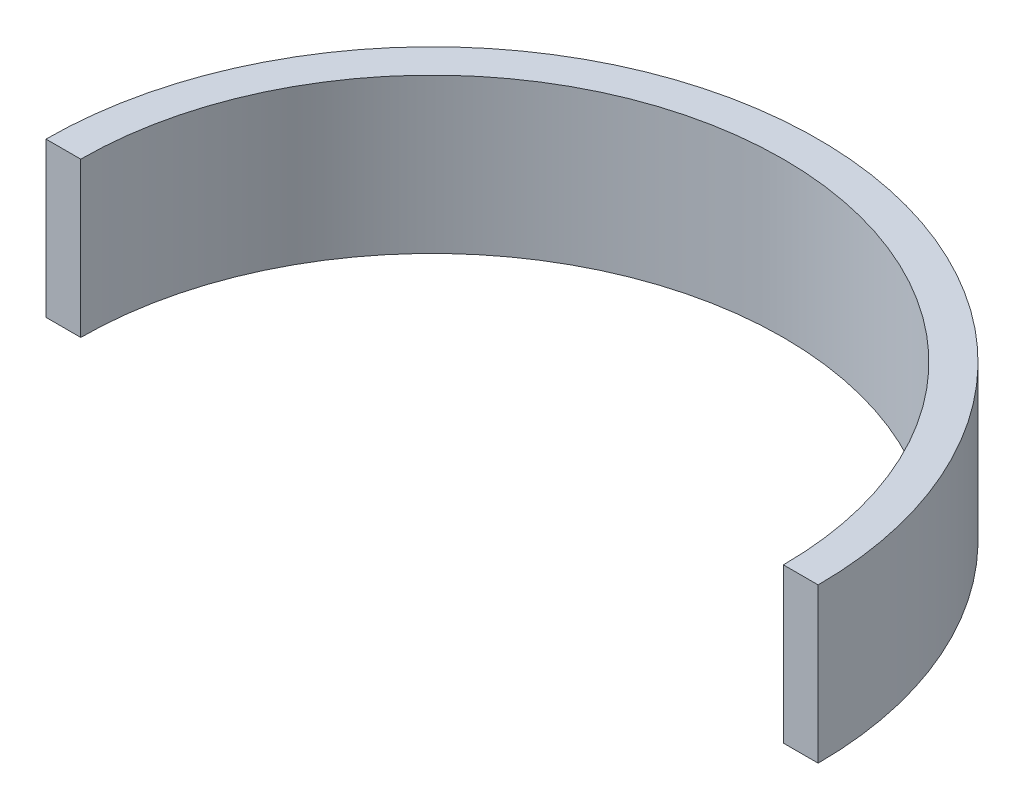
ISO-10303-21;
HEADER;
FILE_DESCRIPTION(('STEP AP214'),'2;1');
FILE_NAME('part.step','',(''),(''),'','','');
FILE_SCHEMA(('AUTOMOTIVE_DESIGN { 1 0 10303 214 1 1 1 1 }'));
ENDSEC;
DATA;
#1=APPLICATION_CONTEXT('core data for automotive mechanical design processes');
#2=APPLICATION_PROTOCOL_DEFINITION('international standard','automotive_design',2000,#1);
#3=PRODUCT_CONTEXT('',#1,'mechanical');
#4=PRODUCT('Part','Part','',(#3));
#5=PRODUCT_RELATED_PRODUCT_CATEGORY('part','',(#4));
#6=PRODUCT_DEFINITION_FORMATION('','',#4);
#7=PRODUCT_DEFINITION_CONTEXT('part definition',#1,'design');
#8=PRODUCT_DEFINITION('design','',#6,#7);
#9=PRODUCT_DEFINITION_SHAPE('','',#8);
#10=(LENGTH_UNIT() NAMED_UNIT(*) SI_UNIT(.MILLI.,.METRE.));
#11=(NAMED_UNIT(*) PLANE_ANGLE_UNIT() SI_UNIT($,.RADIAN.));
#12=(NAMED_UNIT(*) SI_UNIT($,.STERADIAN.) SOLID_ANGLE_UNIT());
#13=UNCERTAINTY_MEASURE_WITH_UNIT(LENGTH_MEASURE(1.E-05),#10,'distance_accuracy_value','');
#14=(GEOMETRIC_REPRESENTATION_CONTEXT(3) GLOBAL_UNCERTAINTY_ASSIGNED_CONTEXT((#13)) GLOBAL_UNIT_ASSIGNED_CONTEXT((#10,
#11,#12)) REPRESENTATION_CONTEXT('',''));
#15=CARTESIAN_POINT('',(0.,0.,0.));
#16=DIRECTION('',(0.,0.,1.));
#17=DIRECTION('',(1.,0.,0.));
#18=AXIS2_PLACEMENT_3D('',#15,#16,#17);
#19=CARTESIAN_POINT('',(0.,20.,0.));
#20=DIRECTION('',(0.,-1.,0.));
#21=DIRECTION('',(0.,0.,-1.));
#22=AXIS2_PLACEMENT_3D('',#19,#20,#21);
#23=CYLINDRICAL_SURFACE('',#22,50.);
#24=CARTESIAN_POINT('',(0.,0.,0.));
#25=DIRECTION('',(0.,1.,0.));
#26=DIRECTION('',(0.,0.,-1.));
#27=AXIS2_PLACEMENT_3D('',#24,#25,#26);
#28=CIRCLE('',#27,50.);
#29=CARTESIAN_POINT('',(50.,0.,0.));
#30=VERTEX_POINT('',#29);
#31=CARTESIAN_POINT('',(-50.,0.,0.));
#32=VERTEX_POINT('',#31);
#33=EDGE_CURVE('E97',#30,#32,#28,.T.);
#34=ORIENTED_EDGE('',*,*,#33,.T.);
#35=DIRECTION('',(0.,-1.,0.));
#36=VECTOR('',#35,1.);
#37=CARTESIAN_POINT('',(-50.,20.,0.));
#38=LINE('',#37,#36);
#39=CARTESIAN_POINT('',(-50.,20.,0.));
#40=VERTEX_POINT('',#39);
#41=EDGE_CURVE('E11',#40,#32,#38,.T.);
#42=ORIENTED_EDGE('',*,*,#41,.F.);
#43=CARTESIAN_POINT('',(0.,20.,0.));
#44=DIRECTION('',(0.,1.,0.));
#45=DIRECTION('',(0.,0.,-1.));
#46=AXIS2_PLACEMENT_3D('',#43,#44,#45);
#47=CIRCLE('',#46,50.);
#48=CARTESIAN_POINT('',(50.,20.,0.));
#49=VERTEX_POINT('',#48);
#50=EDGE_CURVE('E85',#49,#40,#47,.T.);
#51=ORIENTED_EDGE('',*,*,#50,.F.);
#52=DIRECTION('',(0.,-1.,0.));
#53=VECTOR('',#52,1.);
#54=CARTESIAN_POINT('',(50.,20.,0.));
#55=LINE('',#54,#53);
#56=EDGE_CURVE('E93',#49,#30,#55,.T.);
#57=ORIENTED_EDGE('',*,*,#56,.T.);
#58=EDGE_LOOP('',(#34,#42,#51,#57));
#59=FACE_BOUND('',#58,.T.);
#60=ADVANCED_FACE('F34',(#59),#23,.T.);
#61=CARTESIAN_POINT('',(-50.,20.,0.));
#62=DIRECTION('',(0.,0.,-1.));
#63=DIRECTION('',(-1.,0.,0.));
#64=AXIS2_PLACEMENT_3D('',#61,#62,#63);
#65=PLANE('',#64);
#66=DIRECTION('',(1.,0.,0.));
#67=VECTOR('',#66,1.);
#68=CARTESIAN_POINT('',(-50.,0.,0.));
#69=LINE('',#68,#67);
#70=CARTESIAN_POINT('',(-45.5,0.,0.));
#71=VERTEX_POINT('',#70);
#72=EDGE_CURVE('E89',#32,#71,#69,.T.);
#73=ORIENTED_EDGE('',*,*,#72,.T.);
#74=DIRECTION('',(0.,-1.,0.));
#75=VECTOR('',#74,1.);
#76=CARTESIAN_POINT('',(-45.5,20.,0.));
#77=LINE('',#76,#75);
#78=CARTESIAN_POINT('',(-45.5,20.,0.));
#79=VERTEX_POINT('',#78);
#80=EDGE_CURVE('E42',#79,#71,#77,.T.);
#81=ORIENTED_EDGE('',*,*,#80,.F.);
#82=DIRECTION('',(1.,0.,0.));
#83=VECTOR('',#82,1.);
#84=CARTESIAN_POINT('',(-50.,20.,0.));
#85=LINE('',#84,#83);
#86=EDGE_CURVE('E80',#40,#79,#85,.T.);
#87=ORIENTED_EDGE('',*,*,#86,.F.);
#88=ORIENTED_EDGE('',*,*,#41,.T.);
#89=EDGE_LOOP('',(#73,#81,#87,#88));
#90=FACE_BOUND('',#89,.T.);
#91=ADVANCED_FACE('F88',(#90),#65,.F.);
#92=CARTESIAN_POINT('',(0.,20.,0.));
#93=DIRECTION('',(0.,-1.,0.));
#94=DIRECTION('',(0.,0.,-1.));
#95=AXIS2_PLACEMENT_3D('',#92,#93,#94);
#96=CYLINDRICAL_SURFACE('',#95,45.5);
#97=CARTESIAN_POINT('',(0.,0.,0.));
#98=DIRECTION('',(0.,-1.,0.));
#99=DIRECTION('',(0.,0.,-1.));
#100=AXIS2_PLACEMENT_3D('',#97,#98,#99);
#101=CIRCLE('',#100,45.5);
#102=CARTESIAN_POINT('',(45.5,0.,0.));
#103=VERTEX_POINT('',#102);
#104=EDGE_CURVE('E67',#71,#103,#101,.T.);
#105=ORIENTED_EDGE('',*,*,#104,.T.);
#106=DIRECTION('',(0.,-1.,0.));
#107=VECTOR('',#106,1.);
#108=CARTESIAN_POINT('',(45.5,20.,0.));
#109=LINE('',#108,#107);
#110=CARTESIAN_POINT('',(45.5,20.,0.));
#111=VERTEX_POINT('',#110);
#112=EDGE_CURVE('E90',#111,#103,#109,.T.);
#113=ORIENTED_EDGE('',*,*,#112,.F.);
#114=CARTESIAN_POINT('',(0.,20.,0.));
#115=DIRECTION('',(0.,-1.,0.));
#116=DIRECTION('',(0.,0.,-1.));
#117=AXIS2_PLACEMENT_3D('',#114,#115,#116);
#118=CIRCLE('',#117,45.5);
#119=EDGE_CURVE('E83',#79,#111,#118,.T.);
#120=ORIENTED_EDGE('',*,*,#119,.F.);
#121=ORIENTED_EDGE('',*,*,#80,.T.);
#122=EDGE_LOOP('',(#105,#113,#120,#121));
#123=FACE_BOUND('',#122,.T.);
#124=ADVANCED_FACE('F91',(#123),#96,.F.);
#125=CARTESIAN_POINT('',(45.5,20.,0.));
#126=DIRECTION('',(0.,0.,-1.));
#127=DIRECTION('',(-1.,0.,0.));
#128=AXIS2_PLACEMENT_3D('',#125,#126,#127);
#129=PLANE('',#128);
#130=DIRECTION('',(1.,0.,0.));
#131=VECTOR('',#130,1.);
#132=CARTESIAN_POINT('',(45.5,0.,0.));
#133=LINE('',#132,#131);
#134=EDGE_CURVE('E73',#103,#30,#133,.T.);
#135=ORIENTED_EDGE('',*,*,#134,.T.);
#136=ORIENTED_EDGE('',*,*,#56,.F.);
#137=DIRECTION('',(1.,0.,0.));
#138=VECTOR('',#137,1.);
#139=CARTESIAN_POINT('',(45.5,20.,0.));
#140=LINE('',#139,#138);
#141=EDGE_CURVE('E50',#111,#49,#140,.T.);
#142=ORIENTED_EDGE('',*,*,#141,.F.);
#143=ORIENTED_EDGE('',*,*,#112,.T.);
#144=EDGE_LOOP('',(#135,#136,#142,#143));
#145=FACE_BOUND('',#144,.T.);
#146=ADVANCED_FACE('F104',(#145),#129,.F.);
#147=CARTESIAN_POINT('',(0.,20.,0.));
#148=DIRECTION('',(0.,-1.,0.));
#149=DIRECTION('',(0.,0.,-1.));
#150=AXIS2_PLACEMENT_3D('',#147,#148,#149);
#151=PLANE('',#150);
#152=ORIENTED_EDGE('',*,*,#50,.T.);
#153=ORIENTED_EDGE('',*,*,#86,.T.);
#154=ORIENTED_EDGE('',*,*,#119,.T.);
#155=ORIENTED_EDGE('',*,*,#141,.T.);
#156=EDGE_LOOP('',(#152,#153,#154,#155));
#157=FACE_BOUND('',#156,.T.);
#158=ADVANCED_FACE('F81',(#157),#151,.F.);
#159=CARTESIAN_POINT('',(0.,0.,0.));
#160=DIRECTION('',(0.,-1.,0.));
#161=DIRECTION('',(0.,0.,-1.));
#162=AXIS2_PLACEMENT_3D('',#159,#160,#161);
#163=PLANE('',#162);
#164=ORIENTED_EDGE('',*,*,#33,.F.);
#165=ORIENTED_EDGE('',*,*,#134,.F.);
#166=ORIENTED_EDGE('',*,*,#104,.F.);
#167=ORIENTED_EDGE('',*,*,#72,.F.);
#168=EDGE_LOOP('',(#164,#165,#166,#167));
#169=FACE_BOUND('',#168,.T.);
#170=ADVANCED_FACE('F107',(#169),#163,.T.);
#171=CLOSED_SHELL('',(#60,#91,#124,#146,#158,#170));
#172=MANIFOLD_SOLID_BREP('B2',#171);
#173=ADVANCED_BREP_SHAPE_REPRESENTATION('',(#18,#172),#14);
#174=SHAPE_DEFINITION_REPRESENTATION(#9,#173);
ENDSEC;
END-ISO-10303-21;
